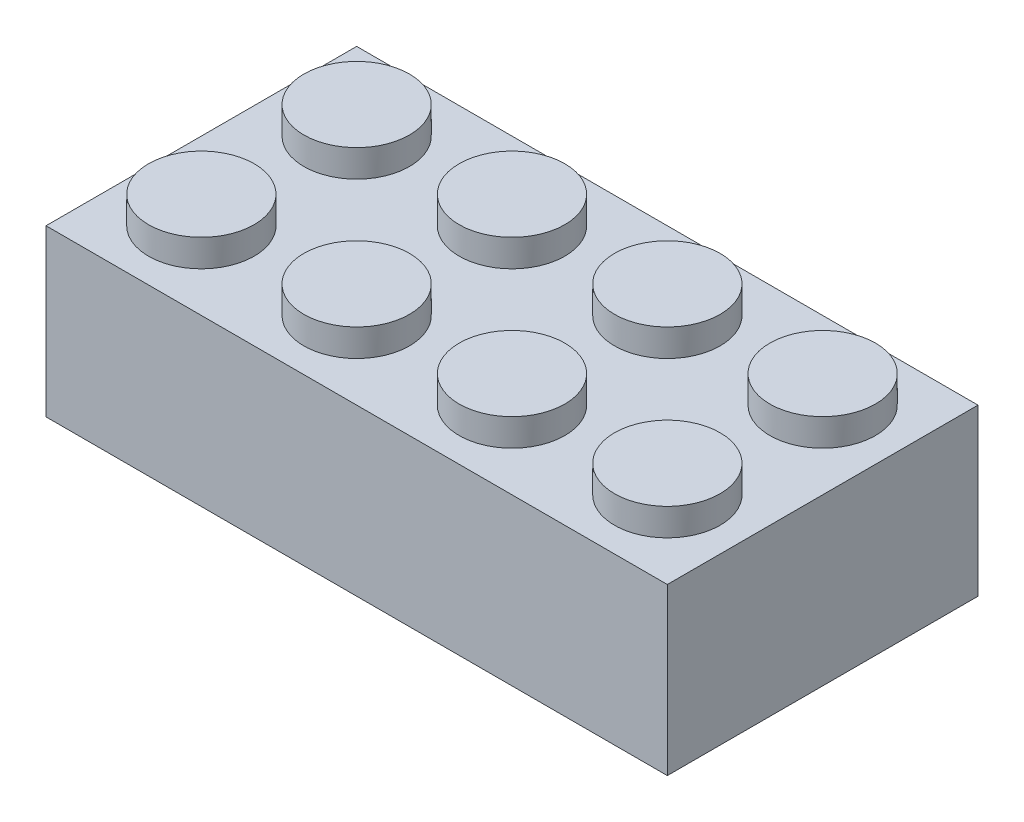
ISO-10303-21;
HEADER;
FILE_DESCRIPTION(('STEP AP214'),'2;1');
FILE_NAME('part.step','',(''),(''),'','','');
FILE_SCHEMA(('AUTOMOTIVE_DESIGN { 1 0 10303 214 1 1 1 1 }'));
ENDSEC;
DATA;
#1=APPLICATION_CONTEXT('core data for automotive mechanical design processes');
#2=APPLICATION_PROTOCOL_DEFINITION('international standard','automotive_design',2000,#1);
#3=PRODUCT_CONTEXT('',#1,'mechanical');
#4=PRODUCT('Part','Part','',(#3));
#5=PRODUCT_RELATED_PRODUCT_CATEGORY('part','',(#4));
#6=PRODUCT_DEFINITION_FORMATION('','',#4);
#7=PRODUCT_DEFINITION_CONTEXT('part definition',#1,'design');
#8=PRODUCT_DEFINITION('design','',#6,#7);
#9=PRODUCT_DEFINITION_SHAPE('','',#8);
#10=(LENGTH_UNIT() NAMED_UNIT(*) SI_UNIT(.MILLI.,.METRE.));
#11=(NAMED_UNIT(*) PLANE_ANGLE_UNIT() SI_UNIT($,.RADIAN.));
#12=(NAMED_UNIT(*) SI_UNIT($,.STERADIAN.) SOLID_ANGLE_UNIT());
#13=UNCERTAINTY_MEASURE_WITH_UNIT(LENGTH_MEASURE(1.E-05),#10,'distance_accuracy_value','');
#14=(GEOMETRIC_REPRESENTATION_CONTEXT(3) GLOBAL_UNCERTAINTY_ASSIGNED_CONTEXT((#13)) GLOBAL_UNIT_ASSIGNED_CONTEXT((#10,
#11,#12)) REPRESENTATION_CONTEXT('',''));
#15=CARTESIAN_POINT('',(0.,0.,0.));
#16=DIRECTION('',(0.,0.,1.));
#17=DIRECTION('',(1.,0.,0.));
#18=AXIS2_PLACEMENT_3D('',#15,#16,#17);
#19=CARTESIAN_POINT('',(-15.875,4.2291,7.9375));
#20=DIRECTION('',(0.,-1.,0.));
#21=DIRECTION('',(0.,0.,-1.));
#22=AXIS2_PLACEMENT_3D('',#19,#20,#21);
#23=PLANE('',#22);
#24=CARTESIAN_POINT('',(11.90625,4.2291,3.96875));
#25=DIRECTION('',(0.,-1.,0.));
#26=DIRECTION('',(0.,0.,-1.));
#27=AXIS2_PLACEMENT_3D('',#24,#25,#26);
#28=CIRCLE('',#27,2.69875);
#29=CARTESIAN_POINT('',(11.90625,4.2291,1.27));
#30=VERTEX_POINT('',#29);
#31=EDGE_CURVE('E194',#30,#30,#28,.F.);
#32=ORIENTED_EDGE('',*,*,#31,.F.);
#33=EDGE_LOOP('',(#32));
#34=FACE_BOUND('',#33,.T.);
#35=DIRECTION('',(0.,0.,1.));
#36=VECTOR('',#35,1.);
#37=CARTESIAN_POINT('',(-15.875,4.2291,-7.9375));
#38=LINE('',#37,#36);
#39=CARTESIAN_POINT('',(-15.875,4.2291,-7.9375));
#40=VERTEX_POINT('',#39);
#41=CARTESIAN_POINT('',(-15.875,4.2291,7.9375));
#42=VERTEX_POINT('',#41);
#43=EDGE_CURVE('E172',#40,#42,#38,.T.);
#44=ORIENTED_EDGE('',*,*,#43,.T.);
#45=DIRECTION('',(1.,0.,0.));
#46=VECTOR('',#45,1.);
#47=CARTESIAN_POINT('',(15.875,4.2291,7.9375));
#48=LINE('',#47,#46);
#49=CARTESIAN_POINT('',(15.875,4.2291,7.9375));
#50=VERTEX_POINT('',#49);
#51=EDGE_CURVE('E114',#42,#50,#48,.T.);
#52=ORIENTED_EDGE('',*,*,#51,.T.);
#53=DIRECTION('',(0.,0.,-1.));
#54=VECTOR('',#53,1.);
#55=CARTESIAN_POINT('',(15.875,4.2291,-7.9375));
#56=LINE('',#55,#54);
#57=CARTESIAN_POINT('',(15.875,4.2291,-7.9375));
#58=VERTEX_POINT('',#57);
#59=EDGE_CURVE('E175',#50,#58,#56,.T.);
#60=ORIENTED_EDGE('',*,*,#59,.T.);
#61=DIRECTION('',(-1.,0.,0.));
#62=VECTOR('',#61,1.);
#63=CARTESIAN_POINT('',(15.875,4.2291,-7.9375));
#64=LINE('',#63,#62);
#65=EDGE_CURVE('E85',#58,#40,#64,.T.);
#66=ORIENTED_EDGE('',*,*,#65,.T.);
#67=EDGE_LOOP('',(#44,#52,#60,#66));
#68=FACE_BOUND('',#67,.T.);
#69=CARTESIAN_POINT('',(3.96875,4.2291,3.96875000000001));
#70=DIRECTION('',(0.,-1.,0.));
#71=DIRECTION('',(0.,0.,-1.));
#72=AXIS2_PLACEMENT_3D('',#69,#70,#71);
#73=CIRCLE('',#72,2.69875);
#74=CARTESIAN_POINT('',(3.96875,4.2291,1.27000000000001));
#75=VERTEX_POINT('',#74);
#76=EDGE_CURVE('E197',#75,#75,#73,.F.);
#77=ORIENTED_EDGE('',*,*,#76,.F.);
#78=EDGE_LOOP('',(#77));
#79=FACE_BOUND('',#78,.T.);
#80=CARTESIAN_POINT('',(-3.96875,4.2291,3.96875000000001));
#81=DIRECTION('',(0.,-1.,0.));
#82=DIRECTION('',(0.,0.,-1.));
#83=AXIS2_PLACEMENT_3D('',#80,#81,#82);
#84=CIRCLE('',#83,2.69875);
#85=CARTESIAN_POINT('',(-3.96875,4.2291,1.27000000000001));
#86=VERTEX_POINT('',#85);
#87=EDGE_CURVE('E200',#86,#86,#84,.F.);
#88=ORIENTED_EDGE('',*,*,#87,.F.);
#89=EDGE_LOOP('',(#88));
#90=FACE_BOUND('',#89,.T.);
#91=CARTESIAN_POINT('',(-11.90625,4.2291,3.96875000000001));
#92=DIRECTION('',(0.,-1.,0.));
#93=DIRECTION('',(0.,0.,-1.));
#94=AXIS2_PLACEMENT_3D('',#91,#92,#93);
#95=CIRCLE('',#94,2.69875);
#96=CARTESIAN_POINT('',(-11.90625,4.2291,1.27000000000001));
#97=VERTEX_POINT('',#96);
#98=EDGE_CURVE('E206',#97,#97,#95,.F.);
#99=ORIENTED_EDGE('',*,*,#98,.F.);
#100=EDGE_LOOP('',(#99));
#101=FACE_BOUND('',#100,.T.);
#102=CARTESIAN_POINT('',(11.90625,4.2291,-3.96875));
#103=DIRECTION('',(0.,-1.,0.));
#104=DIRECTION('',(0.,0.,-1.));
#105=AXIS2_PLACEMENT_3D('',#102,#103,#104);
#106=CIRCLE('',#105,2.69875);
#107=CARTESIAN_POINT('',(11.90625,4.2291,-6.6675));
#108=VERTEX_POINT('',#107);
#109=EDGE_CURVE('E212',#108,#108,#106,.F.);
#110=ORIENTED_EDGE('',*,*,#109,.F.);
#111=EDGE_LOOP('',(#110));
#112=FACE_BOUND('',#111,.T.);
#113=CARTESIAN_POINT('',(3.96875,4.2291,-3.96874999999999));
#114=DIRECTION('',(0.,-1.,0.));
#115=DIRECTION('',(0.,0.,-1.));
#116=AXIS2_PLACEMENT_3D('',#113,#114,#115);
#117=CIRCLE('',#116,2.69875);
#118=CARTESIAN_POINT('',(3.96875,4.2291,-6.66749999999999));
#119=VERTEX_POINT('',#118);
#120=EDGE_CURVE('E218',#119,#119,#117,.F.);
#121=ORIENTED_EDGE('',*,*,#120,.F.);
#122=EDGE_LOOP('',(#121));
#123=FACE_BOUND('',#122,.T.);
#124=CARTESIAN_POINT('',(-3.96875,4.2291,-3.96874999999999));
#125=DIRECTION('',(0.,-1.,0.));
#126=DIRECTION('',(0.,0.,-1.));
#127=AXIS2_PLACEMENT_3D('',#124,#125,#126);
#128=CIRCLE('',#127,2.69875);
#129=CARTESIAN_POINT('',(-3.96875,4.2291,-6.66749999999999));
#130=VERTEX_POINT('',#129);
#131=EDGE_CURVE('E224',#130,#130,#128,.F.);
#132=ORIENTED_EDGE('',*,*,#131,.F.);
#133=EDGE_LOOP('',(#132));
#134=FACE_BOUND('',#133,.T.);
#135=CARTESIAN_POINT('',(-11.90625,4.2291,-3.96874999999999));
#136=DIRECTION('',(0.,-1.,0.));
#137=DIRECTION('',(0.,0.,-1.));
#138=AXIS2_PLACEMENT_3D('',#135,#136,#137);
#139=CIRCLE('',#138,2.69875);
#140=CARTESIAN_POINT('',(-11.90625,4.2291,-6.66749999999999));
#141=VERTEX_POINT('',#140);
#142=EDGE_CURVE('E230',#141,#141,#139,.F.);
#143=ORIENTED_EDGE('',*,*,#142,.F.);
#144=EDGE_LOOP('',(#143));
#145=FACE_BOUND('',#144,.T.);
#146=ADVANCED_FACE('F61',(#34,#68,#79,#90,#101,#112,#123,#134,#145),#23,.F.);
#147=CARTESIAN_POINT('',(-15.875,4.2291,-7.9375));
#148=DIRECTION('',(1.,0.,0.));
#149=DIRECTION('',(0.,0.,-1.));
#150=AXIS2_PLACEMENT_3D('',#147,#148,#149);
#151=PLANE('',#150);
#152=DIRECTION('',(0.,0.,1.));
#153=VECTOR('',#152,1.);
#154=CARTESIAN_POINT('',(-15.875,-4.2291,-7.9375));
#155=LINE('',#154,#153);
#156=CARTESIAN_POINT('',(-15.875,-4.2291,-7.9375));
#157=VERTEX_POINT('',#156);
#158=CARTESIAN_POINT('',(-15.875,-4.2291,7.9375));
#159=VERTEX_POINT('',#158);
#160=EDGE_CURVE('E170',#157,#159,#155,.T.);
#161=ORIENTED_EDGE('',*,*,#160,.T.);
#162=DIRECTION('',(0.,-1.,0.));
#163=VECTOR('',#162,1.);
#164=CARTESIAN_POINT('',(-15.875,4.2291,7.9375));
#165=LINE('',#164,#163);
#166=EDGE_CURVE('E192',#42,#159,#165,.T.);
#167=ORIENTED_EDGE('',*,*,#166,.F.);
#168=ORIENTED_EDGE('',*,*,#43,.F.);
#169=DIRECTION('',(0.,-1.,0.));
#170=VECTOR('',#169,1.);
#171=CARTESIAN_POINT('',(-15.875,4.2291,-7.9375));
#172=LINE('',#171,#170);
#173=EDGE_CURVE('E178',#40,#157,#172,.T.);
#174=ORIENTED_EDGE('',*,*,#173,.T.);
#175=EDGE_LOOP('',(#161,#167,#168,#174));
#176=FACE_BOUND('',#175,.T.);
#177=ADVANCED_FACE('F274',(#176),#151,.F.);
#178=CARTESIAN_POINT('',(15.875,4.2291,7.9375));
#179=DIRECTION('',(0.,0.,-1.));
#180=DIRECTION('',(-1.,0.,0.));
#181=AXIS2_PLACEMENT_3D('',#178,#179,#180);
#182=PLANE('',#181);
#183=DIRECTION('',(1.,0.,0.));
#184=VECTOR('',#183,1.);
#185=CARTESIAN_POINT('',(15.875,-4.2291,7.9375));
#186=LINE('',#185,#184);
#187=CARTESIAN_POINT('',(15.875,-4.2291,7.9375));
#188=VERTEX_POINT('',#187);
#189=EDGE_CURVE('E181',#159,#188,#186,.T.);
#190=ORIENTED_EDGE('',*,*,#189,.T.);
#191=DIRECTION('',(0.,-1.,0.));
#192=VECTOR('',#191,1.);
#193=CARTESIAN_POINT('',(15.875,4.2291,7.9375));
#194=LINE('',#193,#192);
#195=EDGE_CURVE('E189',#50,#188,#194,.T.);
#196=ORIENTED_EDGE('',*,*,#195,.F.);
#197=ORIENTED_EDGE('',*,*,#51,.F.);
#198=ORIENTED_EDGE('',*,*,#166,.T.);
#199=EDGE_LOOP('',(#190,#196,#197,#198));
#200=FACE_BOUND('',#199,.T.);
#201=ADVANCED_FACE('F279',(#200),#182,.F.);
#202=CARTESIAN_POINT('',(15.875,4.2291,-7.9375));
#203=DIRECTION('',(-1.,0.,0.));
#204=DIRECTION('',(0.,0.,1.));
#205=AXIS2_PLACEMENT_3D('',#202,#203,#204);
#206=PLANE('',#205);
#207=DIRECTION('',(0.,0.,-1.));
#208=VECTOR('',#207,1.);
#209=CARTESIAN_POINT('',(15.875,-4.2291,-7.9375));
#210=LINE('',#209,#208);
#211=CARTESIAN_POINT('',(15.875,-4.2291,-7.9375));
#212=VERTEX_POINT('',#211);
#213=EDGE_CURVE('E183',#188,#212,#210,.T.);
#214=ORIENTED_EDGE('',*,*,#213,.T.);
#215=DIRECTION('',(0.,-1.,0.));
#216=VECTOR('',#215,1.);
#217=CARTESIAN_POINT('',(15.875,4.2291,-7.9375));
#218=LINE('',#217,#216);
#219=EDGE_CURVE('E187',#58,#212,#218,.T.);
#220=ORIENTED_EDGE('',*,*,#219,.F.);
#221=ORIENTED_EDGE('',*,*,#59,.F.);
#222=ORIENTED_EDGE('',*,*,#195,.T.);
#223=EDGE_LOOP('',(#214,#220,#221,#222));
#224=FACE_BOUND('',#223,.T.);
#225=ADVANCED_FACE('F286',(#224),#206,.F.);
#226=CARTESIAN_POINT('',(15.875,4.2291,-7.9375));
#227=DIRECTION('',(0.,0.,1.));
#228=DIRECTION('',(1.,0.,0.));
#229=AXIS2_PLACEMENT_3D('',#226,#227,#228);
#230=PLANE('',#229);
#231=DIRECTION('',(-1.,0.,0.));
#232=VECTOR('',#231,1.);
#233=CARTESIAN_POINT('',(15.875,-4.2291,-7.9375));
#234=LINE('',#233,#232);
#235=EDGE_CURVE('E106',#212,#157,#234,.T.);
#236=ORIENTED_EDGE('',*,*,#235,.T.);
#237=ORIENTED_EDGE('',*,*,#173,.F.);
#238=ORIENTED_EDGE('',*,*,#65,.F.);
#239=ORIENTED_EDGE('',*,*,#219,.T.);
#240=EDGE_LOOP('',(#236,#237,#238,#239));
#241=FACE_BOUND('',#240,.T.);
#242=ADVANCED_FACE('F269',(#241),#230,.F.);
#243=CARTESIAN_POINT('',(-15.875,-4.2291,7.9375));
#244=DIRECTION('',(0.,-1.,0.));
#245=DIRECTION('',(0.,0.,-1.));
#246=AXIS2_PLACEMENT_3D('',#243,#244,#245);
#247=PLANE('',#246);
#248=DIRECTION('',(0.,0.,1.));
#249=VECTOR('',#248,1.);
#250=CARTESIAN_POINT('',(14.605,-4.2291,-27.7520581765825));
#251=LINE('',#250,#249);
#252=CARTESIAN_POINT('',(14.605,-4.2291,-6.6675));
#253=VERTEX_POINT('',#252);
#254=CARTESIAN_POINT('',(14.605,-4.2291,6.6675));
#255=VERTEX_POINT('',#254);
#256=EDGE_CURVE('E76',#253,#255,#251,.T.);
#257=ORIENTED_EDGE('',*,*,#256,.F.);
#258=DIRECTION('',(1.,0.,0.));
#259=VECTOR('',#258,1.);
#260=CARTESIAN_POINT('',(0.,-4.2291,-6.6675));
#261=LINE('',#260,#259);
#262=CARTESIAN_POINT('',(-14.605,-4.2291,-6.6675));
#263=VERTEX_POINT('',#262);
#264=EDGE_CURVE('E159',#263,#253,#261,.T.);
#265=ORIENTED_EDGE('',*,*,#264,.F.);
#266=DIRECTION('',(0.,0.,-1.));
#267=VECTOR('',#266,1.);
#268=CARTESIAN_POINT('',(-14.605,-4.2291,-27.7520581765825));
#269=LINE('',#268,#267);
#270=CARTESIAN_POINT('',(-14.605,-4.2291,6.6675));
#271=VERTEX_POINT('',#270);
#272=EDGE_CURVE('E142',#271,#263,#269,.T.);
#273=ORIENTED_EDGE('',*,*,#272,.F.);
#274=DIRECTION('',(-1.,0.,0.));
#275=VECTOR('',#274,1.);
#276=CARTESIAN_POINT('',(0.,-4.2291,6.6675));
#277=LINE('',#276,#275);
#278=EDGE_CURVE('E152',#255,#271,#277,.T.);
#279=ORIENTED_EDGE('',*,*,#278,.F.);
#280=EDGE_LOOP('',(#257,#265,#273,#279));
#281=FACE_BOUND('',#280,.T.);
#282=ORIENTED_EDGE('',*,*,#160,.F.);
#283=ORIENTED_EDGE('',*,*,#235,.F.);
#284=ORIENTED_EDGE('',*,*,#213,.F.);
#285=ORIENTED_EDGE('',*,*,#189,.F.);
#286=EDGE_LOOP('',(#282,#283,#284,#285));
#287=FACE_BOUND('',#286,.T.);
#288=ADVANCED_FACE('F156',(#281,#287),#247,.T.);
#289=CARTESIAN_POINT('',(14.605,36.3390100746171,-27.7520581765825));
#290=DIRECTION('',(1.,0.,0.));
#291=DIRECTION('',(0.,0.,-1.));
#292=AXIS2_PLACEMENT_3D('',#289,#290,#291);
#293=PLANE('',#292);
#294=DIRECTION('',(0.,0.,-1.));
#295=VECTOR('',#294,1.);
#296=CARTESIAN_POINT('',(14.605,2.9591,-27.7520581765825));
#297=LINE('',#296,#295);
#298=CARTESIAN_POINT('',(14.605,2.9591,6.6675));
#299=VERTEX_POINT('',#298);
#300=CARTESIAN_POINT('',(14.605,2.9591,-6.6675));
#301=VERTEX_POINT('',#300);
#302=EDGE_CURVE('E171',#299,#301,#297,.T.);
#303=ORIENTED_EDGE('',*,*,#302,.T.);
#304=DIRECTION('',(0.,-1.,0.));
#305=VECTOR('',#304,1.);
#306=CARTESIAN_POINT('',(14.605,36.3390100746171,-6.6675));
#307=LINE('',#306,#305);
#308=EDGE_CURVE('E164',#301,#253,#307,.T.);
#309=ORIENTED_EDGE('',*,*,#308,.T.);
#310=ORIENTED_EDGE('',*,*,#256,.T.);
#311=DIRECTION('',(0.,-1.,0.));
#312=VECTOR('',#311,1.);
#313=CARTESIAN_POINT('',(14.605,36.3390100746171,6.66749999999999));
#314=LINE('',#313,#312);
#315=EDGE_CURVE('E149',#299,#255,#314,.T.);
#316=ORIENTED_EDGE('',*,*,#315,.F.);
#317=EDGE_LOOP('',(#303,#309,#310,#316));
#318=FACE_BOUND('',#317,.T.);
#319=ADVANCED_FACE('F259',(#318),#293,.F.);
#320=CARTESIAN_POINT('',(0.,36.3390100746171,-6.6675));
#321=DIRECTION('',(0.,0.,-1.));
#322=DIRECTION('',(-1.,0.,0.));
#323=AXIS2_PLACEMENT_3D('',#320,#321,#322);
#324=PLANE('',#323);
#325=DIRECTION('',(-1.,0.,0.));
#326=VECTOR('',#325,1.);
#327=CARTESIAN_POINT('',(0.,2.9591,-6.6675));
#328=LINE('',#327,#326);
#329=CARTESIAN_POINT('',(-14.605,2.9591,-6.6675));
#330=VERTEX_POINT('',#329);
#331=EDGE_CURVE('E256',#301,#330,#328,.T.);
#332=ORIENTED_EDGE('',*,*,#331,.T.);
#333=DIRECTION('',(0.,-1.,0.));
#334=VECTOR('',#333,1.);
#335=CARTESIAN_POINT('',(-14.605,36.3390100746171,-6.6675));
#336=LINE('',#335,#334);
#337=EDGE_CURVE('E148',#330,#263,#336,.T.);
#338=ORIENTED_EDGE('',*,*,#337,.T.);
#339=ORIENTED_EDGE('',*,*,#264,.T.);
#340=ORIENTED_EDGE('',*,*,#308,.F.);
#341=EDGE_LOOP('',(#332,#338,#339,#340));
#342=FACE_BOUND('',#341,.T.);
#343=ADVANCED_FACE('F261',(#342),#324,.F.);
#344=CARTESIAN_POINT('',(-14.605,36.3390100746171,-27.7520581765825));
#345=DIRECTION('',(-1.,0.,0.));
#346=DIRECTION('',(0.,0.,1.));
#347=AXIS2_PLACEMENT_3D('',#344,#345,#346);
#348=PLANE('',#347);
#349=DIRECTION('',(0.,0.,1.));
#350=VECTOR('',#349,1.);
#351=CARTESIAN_POINT('',(-14.605,2.9591,-27.7520581765825));
#352=LINE('',#351,#350);
#353=CARTESIAN_POINT('',(-14.605,2.9591,6.6675));
#354=VERTEX_POINT('',#353);
#355=EDGE_CURVE('E145',#330,#354,#352,.T.);
#356=ORIENTED_EDGE('',*,*,#355,.T.);
#357=DIRECTION('',(0.,-1.,0.));
#358=VECTOR('',#357,1.);
#359=CARTESIAN_POINT('',(-14.605,36.3390100746171,6.6675));
#360=LINE('',#359,#358);
#361=EDGE_CURVE('E137',#354,#271,#360,.T.);
#362=ORIENTED_EDGE('',*,*,#361,.T.);
#363=ORIENTED_EDGE('',*,*,#272,.T.);
#364=ORIENTED_EDGE('',*,*,#337,.F.);
#365=EDGE_LOOP('',(#356,#362,#363,#364));
#366=FACE_BOUND('',#365,.T.);
#367=ADVANCED_FACE('F139',(#366),#348,.F.);
#368=CARTESIAN_POINT('',(0.,36.3390100746171,6.6675));
#369=DIRECTION('',(0.,0.,1.));
#370=DIRECTION('',(1.,0.,0.));
#371=AXIS2_PLACEMENT_3D('',#368,#369,#370);
#372=PLANE('',#371);
#373=DIRECTION('',(1.,0.,0.));
#374=VECTOR('',#373,1.);
#375=CARTESIAN_POINT('',(0.,2.9591,6.6675));
#376=LINE('',#375,#374);
#377=EDGE_CURVE('E168',#354,#299,#376,.T.);
#378=ORIENTED_EDGE('',*,*,#377,.T.);
#379=ORIENTED_EDGE('',*,*,#315,.T.);
#380=ORIENTED_EDGE('',*,*,#278,.T.);
#381=ORIENTED_EDGE('',*,*,#361,.F.);
#382=EDGE_LOOP('',(#378,#379,#380,#381));
#383=FACE_BOUND('',#382,.T.);
#384=ADVANCED_FACE('F153',(#383),#372,.F.);
#385=CARTESIAN_POINT('',(-15.875,2.9591,7.9375));
#386=DIRECTION('',(0.,-1.,0.));
#387=DIRECTION('',(0.,0.,-1.));
#388=AXIS2_PLACEMENT_3D('',#385,#386,#387);
#389=PLANE('',#388);
#390=CARTESIAN_POINT('',(7.9375,2.9591,0.));
#391=DIRECTION('',(0.,-1.,0.));
#392=DIRECTION('',(0.,0.,-1.));
#393=AXIS2_PLACEMENT_3D('',#390,#391,#392);
#394=CIRCLE('',#393,3.175);
#395=CARTESIAN_POINT('',(7.9375,2.9591,-3.175));
#396=VERTEX_POINT('',#395);
#397=EDGE_CURVE('E13',#396,#396,#394,.T.);
#398=ORIENTED_EDGE('',*,*,#397,.F.);
#399=EDGE_LOOP('',(#398));
#400=FACE_BOUND('',#399,.T.);
#401=CARTESIAN_POINT('',(-7.9375,2.9591,0.));
#402=DIRECTION('',(0.,-1.,0.));
#403=DIRECTION('',(0.,0.,-1.));
#404=AXIS2_PLACEMENT_3D('',#401,#402,#403);
#405=CIRCLE('',#404,3.175);
#406=CARTESIAN_POINT('',(-7.9375,2.9591,-3.175));
#407=VERTEX_POINT('',#406);
#408=EDGE_CURVE('E69',#407,#407,#405,.T.);
#409=ORIENTED_EDGE('',*,*,#408,.F.);
#410=EDGE_LOOP('',(#409));
#411=FACE_BOUND('',#410,.T.);
#412=CARTESIAN_POINT('',(0.,2.9591,0.));
#413=DIRECTION('',(0.,-1.,0.));
#414=DIRECTION('',(0.,0.,-1.));
#415=AXIS2_PLACEMENT_3D('',#412,#413,#414);
#416=CIRCLE('',#415,3.175);
#417=CARTESIAN_POINT('',(0.,2.9591,-3.175));
#418=VERTEX_POINT('',#417);
#419=EDGE_CURVE('E236',#418,#418,#416,.T.);
#420=ORIENTED_EDGE('',*,*,#419,.F.);
#421=EDGE_LOOP('',(#420));
#422=FACE_BOUND('',#421,.T.);
#423=ORIENTED_EDGE('',*,*,#302,.F.);
#424=ORIENTED_EDGE('',*,*,#377,.F.);
#425=ORIENTED_EDGE('',*,*,#355,.F.);
#426=ORIENTED_EDGE('',*,*,#331,.F.);
#427=EDGE_LOOP('',(#423,#424,#425,#426));
#428=FACE_BOUND('',#427,.T.);
#429=ADVANCED_FACE('F244',(#400,#411,#422,#428),#389,.T.);
#430=CARTESIAN_POINT('',(11.90625,5.6261,3.96875));
#431=DIRECTION('',(0.,-1.,0.));
#432=DIRECTION('',(0.,0.,-1.));
#433=AXIS2_PLACEMENT_3D('',#430,#431,#432);
#434=CYLINDRICAL_SURFACE('',#433,2.69875);
#435=CARTESIAN_POINT('',(11.90625,5.6261,3.96875));
#436=DIRECTION('',(0.,1.,0.));
#437=DIRECTION('',(0.,0.,1.));
#438=AXIS2_PLACEMENT_3D('',#435,#436,#437);
#439=CIRCLE('',#438,2.69875);
#440=CARTESIAN_POINT('',(11.90625,5.6261,6.6675));
#441=VERTEX_POINT('',#440);
#442=EDGE_CURVE('E663',#441,#441,#439,.T.);
#443=ORIENTED_EDGE('',*,*,#442,.F.);
#444=EDGE_LOOP('',(#443));
#445=FACE_BOUND('',#444,.T.);
#446=ORIENTED_EDGE('',*,*,#31,.T.);
#447=EDGE_LOOP('',(#446));
#448=FACE_BOUND('',#447,.T.);
#449=ADVANCED_FACE('F247',(#445,#448),#434,.T.);
#450=CARTESIAN_POINT('',(11.90625,5.6261,3.96875));
#451=DIRECTION('',(0.,1.,0.));
#452=DIRECTION('',(0.,0.,1.));
#453=AXIS2_PLACEMENT_3D('',#450,#451,#452);
#454=PLANE('',#453);
#455=ORIENTED_EDGE('',*,*,#442,.T.);
#456=EDGE_LOOP('',(#455));
#457=FACE_BOUND('',#456,.T.);
#458=ADVANCED_FACE('F404',(#457),#454,.T.);
#459=CARTESIAN_POINT('',(3.96875,5.6261,3.96875000000001));
#460=DIRECTION('',(0.,-1.,0.));
#461=DIRECTION('',(0.,0.,-1.));
#462=AXIS2_PLACEMENT_3D('',#459,#460,#461);
#463=CYLINDRICAL_SURFACE('',#462,2.69875);
#464=CARTESIAN_POINT('',(3.96875,5.6261,3.96875000000001));
#465=DIRECTION('',(0.,1.,0.));
#466=DIRECTION('',(0.,0.,1.));
#467=AXIS2_PLACEMENT_3D('',#464,#465,#466);
#468=CIRCLE('',#467,2.69875);
#469=CARTESIAN_POINT('',(3.96875,5.6261,6.6675));
#470=VERTEX_POINT('',#469);
#471=EDGE_CURVE('E660',#470,#470,#468,.T.);
#472=ORIENTED_EDGE('',*,*,#471,.F.);
#473=EDGE_LOOP('',(#472));
#474=FACE_BOUND('',#473,.T.);
#475=ORIENTED_EDGE('',*,*,#76,.T.);
#476=EDGE_LOOP('',(#475));
#477=FACE_BOUND('',#476,.T.);
#478=ADVANCED_FACE('F396',(#474,#477),#463,.T.);
#479=CARTESIAN_POINT('',(3.96875,5.6261,3.96875000000001));
#480=DIRECTION('',(0.,1.,0.));
#481=DIRECTION('',(0.,0.,1.));
#482=AXIS2_PLACEMENT_3D('',#479,#480,#481);
#483=PLANE('',#482);
#484=ORIENTED_EDGE('',*,*,#471,.T.);
#485=EDGE_LOOP('',(#484));
#486=FACE_BOUND('',#485,.T.);
#487=ADVANCED_FACE('F300',(#486),#483,.T.);
#488=CARTESIAN_POINT('',(-3.96875,5.6261,3.96875000000001));
#489=DIRECTION('',(0.,1.,0.));
#490=DIRECTION('',(0.,0.,1.));
#491=AXIS2_PLACEMENT_3D('',#488,#489,#490);
#492=PLANE('',#491);
#493=CARTESIAN_POINT('',(-3.96875,5.6261,3.96875000000001));
#494=DIRECTION('',(0.,1.,0.));
#495=DIRECTION('',(0.,0.,1.));
#496=AXIS2_PLACEMENT_3D('',#493,#494,#495);
#497=CIRCLE('',#496,2.69875);
#498=CARTESIAN_POINT('',(-3.96875,5.6261,6.66750000000001));
#499=VERTEX_POINT('',#498);
#500=EDGE_CURVE('E203',#499,#499,#497,.T.);
#501=ORIENTED_EDGE('',*,*,#500,.T.);
#502=EDGE_LOOP('',(#501));
#503=FACE_BOUND('',#502,.T.);
#504=ADVANCED_FACE('F296',(#503),#492,.T.);
#505=CARTESIAN_POINT('',(-3.96875,5.6261,3.96875000000001));
#506=DIRECTION('',(0.,-1.,0.));
#507=DIRECTION('',(0.,0.,-1.));
#508=AXIS2_PLACEMENT_3D('',#505,#506,#507);
#509=CYLINDRICAL_SURFACE('',#508,2.69875);
#510=ORIENTED_EDGE('',*,*,#500,.F.);
#511=EDGE_LOOP('',(#510));
#512=FACE_BOUND('',#511,.T.);
#513=ORIENTED_EDGE('',*,*,#87,.T.);
#514=EDGE_LOOP('',(#513));
#515=FACE_BOUND('',#514,.T.);
#516=ADVANCED_FACE('F292',(#512,#515),#509,.T.);
#517=CARTESIAN_POINT('',(-11.90625,5.6261,3.96875000000001));
#518=DIRECTION('',(0.,1.,0.));
#519=DIRECTION('',(0.,0.,1.));
#520=AXIS2_PLACEMENT_3D('',#517,#518,#519);
#521=PLANE('',#520);
#522=CARTESIAN_POINT('',(-11.90625,5.6261,3.96875000000001));
#523=DIRECTION('',(0.,1.,0.));
#524=DIRECTION('',(0.,0.,1.));
#525=AXIS2_PLACEMENT_3D('',#522,#523,#524);
#526=CIRCLE('',#525,2.69875);
#527=CARTESIAN_POINT('',(-11.90625,5.6261,6.66750000000001));
#528=VERTEX_POINT('',#527);
#529=EDGE_CURVE('E209',#528,#528,#526,.T.);
#530=ORIENTED_EDGE('',*,*,#529,.T.);
#531=EDGE_LOOP('',(#530));
#532=FACE_BOUND('',#531,.T.);
#533=ADVANCED_FACE('F295',(#532),#521,.T.);
#534=CARTESIAN_POINT('',(-11.90625,5.6261,3.96875000000001));
#535=DIRECTION('',(0.,-1.,0.));
#536=DIRECTION('',(0.,0.,-1.));
#537=AXIS2_PLACEMENT_3D('',#534,#535,#536);
#538=CYLINDRICAL_SURFACE('',#537,2.69875);
#539=ORIENTED_EDGE('',*,*,#529,.F.);
#540=EDGE_LOOP('',(#539));
#541=FACE_BOUND('',#540,.T.);
#542=ORIENTED_EDGE('',*,*,#98,.T.);
#543=EDGE_LOOP('',(#542));
#544=FACE_BOUND('',#543,.T.);
#545=ADVANCED_FACE('F302',(#541,#544),#538,.T.);
#546=CARTESIAN_POINT('',(11.90625,5.6261,-3.96875));
#547=DIRECTION('',(0.,1.,0.));
#548=DIRECTION('',(0.,0.,1.));
#549=AXIS2_PLACEMENT_3D('',#546,#547,#548);
#550=PLANE('',#549);
#551=CARTESIAN_POINT('',(11.90625,5.6261,-3.96875));
#552=DIRECTION('',(0.,1.,0.));
#553=DIRECTION('',(0.,0.,1.));
#554=AXIS2_PLACEMENT_3D('',#551,#552,#553);
#555=CIRCLE('',#554,2.69875);
#556=CARTESIAN_POINT('',(11.90625,5.6261,-1.27));
#557=VERTEX_POINT('',#556);
#558=EDGE_CURVE('E215',#557,#557,#555,.T.);
#559=ORIENTED_EDGE('',*,*,#558,.T.);
#560=EDGE_LOOP('',(#559));
#561=FACE_BOUND('',#560,.T.);
#562=ADVANCED_FACE('F305',(#561),#550,.T.);
#563=CARTESIAN_POINT('',(11.90625,5.6261,-3.96875));
#564=DIRECTION('',(0.,-1.,0.));
#565=DIRECTION('',(0.,0.,-1.));
#566=AXIS2_PLACEMENT_3D('',#563,#564,#565);
#567=CYLINDRICAL_SURFACE('',#566,2.69875);
#568=ORIENTED_EDGE('',*,*,#558,.F.);
#569=EDGE_LOOP('',(#568));
#570=FACE_BOUND('',#569,.T.);
#571=ORIENTED_EDGE('',*,*,#109,.T.);
#572=EDGE_LOOP('',(#571));
#573=FACE_BOUND('',#572,.T.);
#574=ADVANCED_FACE('F310',(#570,#573),#567,.T.);
#575=CARTESIAN_POINT('',(3.96875,5.6261,-3.96874999999999));
#576=DIRECTION('',(0.,1.,0.));
#577=DIRECTION('',(0.,0.,1.));
#578=AXIS2_PLACEMENT_3D('',#575,#576,#577);
#579=PLANE('',#578);
#580=CARTESIAN_POINT('',(3.96875,5.6261,-3.96874999999999));
#581=DIRECTION('',(0.,1.,0.));
#582=DIRECTION('',(0.,0.,1.));
#583=AXIS2_PLACEMENT_3D('',#580,#581,#582);
#584=CIRCLE('',#583,2.69875);
#585=CARTESIAN_POINT('',(3.96875,5.6261,-1.27));
#586=VERTEX_POINT('',#585);
#587=EDGE_CURVE('E221',#586,#586,#584,.T.);
#588=ORIENTED_EDGE('',*,*,#587,.T.);
#589=EDGE_LOOP('',(#588));
#590=FACE_BOUND('',#589,.T.);
#591=ADVANCED_FACE('F313',(#590),#579,.T.);
#592=CARTESIAN_POINT('',(3.96875,5.6261,-3.96874999999999));
#593=DIRECTION('',(0.,-1.,0.));
#594=DIRECTION('',(0.,0.,-1.));
#595=AXIS2_PLACEMENT_3D('',#592,#593,#594);
#596=CYLINDRICAL_SURFACE('',#595,2.69875);
#597=ORIENTED_EDGE('',*,*,#587,.F.);
#598=EDGE_LOOP('',(#597));
#599=FACE_BOUND('',#598,.T.);
#600=ORIENTED_EDGE('',*,*,#120,.T.);
#601=EDGE_LOOP('',(#600));
#602=FACE_BOUND('',#601,.T.);
#603=ADVANCED_FACE('F318',(#599,#602),#596,.T.);
#604=CARTESIAN_POINT('',(-3.96875,5.6261,-3.96874999999999));
#605=DIRECTION('',(0.,1.,0.));
#606=DIRECTION('',(0.,0.,1.));
#607=AXIS2_PLACEMENT_3D('',#604,#605,#606);
#608=PLANE('',#607);
#609=CARTESIAN_POINT('',(-3.96875,5.6261,-3.96874999999999));
#610=DIRECTION('',(0.,1.,0.));
#611=DIRECTION('',(0.,0.,1.));
#612=AXIS2_PLACEMENT_3D('',#609,#610,#611);
#613=CIRCLE('',#612,2.69875);
#614=CARTESIAN_POINT('',(-3.96875,5.6261,-1.26999999999999));
#615=VERTEX_POINT('',#614);
#616=EDGE_CURVE('E227',#615,#615,#613,.T.);
#617=ORIENTED_EDGE('',*,*,#616,.T.);
#618=EDGE_LOOP('',(#617));
#619=FACE_BOUND('',#618,.T.);
#620=ADVANCED_FACE('F321',(#619),#608,.T.);
#621=CARTESIAN_POINT('',(-3.96875,5.6261,-3.96874999999999));
#622=DIRECTION('',(0.,-1.,0.));
#623=DIRECTION('',(0.,0.,-1.));
#624=AXIS2_PLACEMENT_3D('',#621,#622,#623);
#625=CYLINDRICAL_SURFACE('',#624,2.69875);
#626=ORIENTED_EDGE('',*,*,#616,.F.);
#627=EDGE_LOOP('',(#626));
#628=FACE_BOUND('',#627,.T.);
#629=ORIENTED_EDGE('',*,*,#131,.T.);
#630=EDGE_LOOP('',(#629));
#631=FACE_BOUND('',#630,.T.);
#632=ADVANCED_FACE('F326',(#628,#631),#625,.T.);
#633=CARTESIAN_POINT('',(-11.90625,5.6261,-3.96874999999999));
#634=DIRECTION('',(0.,1.,0.));
#635=DIRECTION('',(0.,0.,1.));
#636=AXIS2_PLACEMENT_3D('',#633,#634,#635);
#637=PLANE('',#636);
#638=CARTESIAN_POINT('',(-11.90625,5.6261,-3.96874999999999));
#639=DIRECTION('',(0.,1.,0.));
#640=DIRECTION('',(0.,0.,1.));
#641=AXIS2_PLACEMENT_3D('',#638,#639,#640);
#642=CIRCLE('',#641,2.69875);
#643=CARTESIAN_POINT('',(-11.90625,5.6261,-1.26999999999999));
#644=VERTEX_POINT('',#643);
#645=EDGE_CURVE('E233',#644,#644,#642,.T.);
#646=ORIENTED_EDGE('',*,*,#645,.T.);
#647=EDGE_LOOP('',(#646));
#648=FACE_BOUND('',#647,.T.);
#649=ADVANCED_FACE('F63',(#648),#637,.T.);
#650=CARTESIAN_POINT('',(-11.90625,5.6261,-3.96874999999999));
#651=DIRECTION('',(0.,-1.,0.));
#652=DIRECTION('',(0.,0.,-1.));
#653=AXIS2_PLACEMENT_3D('',#650,#651,#652);
#654=CYLINDRICAL_SURFACE('',#653,2.69875);
#655=ORIENTED_EDGE('',*,*,#645,.F.);
#656=EDGE_LOOP('',(#655));
#657=FACE_BOUND('',#656,.T.);
#658=ORIENTED_EDGE('',*,*,#142,.T.);
#659=EDGE_LOOP('',(#658));
#660=FACE_BOUND('',#659,.T.);
#661=ADVANCED_FACE('F332',(#657,#660),#654,.T.);
#662=CARTESIAN_POINT('',(0.,11.9393561210692,0.));
#663=DIRECTION('',(0.,-1.,0.));
#664=DIRECTION('',(0.,0.,-1.));
#665=AXIS2_PLACEMENT_3D('',#662,#663,#664);
#666=CYLINDRICAL_SURFACE('',#665,3.175);
#667=ORIENTED_EDGE('',*,*,#419,.T.);
#668=EDGE_LOOP('',(#667));
#669=FACE_BOUND('',#668,.T.);
#670=CARTESIAN_POINT('',(0.,-4.2291,0.));
#671=DIRECTION('',(0.,-1.,0.));
#672=DIRECTION('',(0.,0.,-1.));
#673=AXIS2_PLACEMENT_3D('',#670,#671,#672);
#674=CIRCLE('',#673,3.175);
#675=CARTESIAN_POINT('',(0.,-4.2291,-3.175));
#676=VERTEX_POINT('',#675);
#677=EDGE_CURVE('E654',#676,#676,#674,.T.);
#678=ORIENTED_EDGE('',*,*,#677,.F.);
#679=EDGE_LOOP('',(#678));
#680=FACE_BOUND('',#679,.T.);
#681=ADVANCED_FACE('F334',(#669,#680),#666,.T.);
#682=CARTESIAN_POINT('',(0.,-4.2291,-27.7520581765825));
#683=DIRECTION('',(0.,-1.,0.));
#684=DIRECTION('',(0.,0.,-1.));
#685=AXIS2_PLACEMENT_3D('',#682,#683,#684);
#686=PLANE('',#685);
#687=CARTESIAN_POINT('',(0.,-4.2291,0.));
#688=DIRECTION('',(0.,-1.,0.));
#689=DIRECTION('',(0.,0.,-1.));
#690=AXIS2_PLACEMENT_3D('',#687,#688,#689);
#691=CIRCLE('',#690,2.413);
#692=CARTESIAN_POINT('',(0.,-4.2291,-2.413));
#693=VERTEX_POINT('',#692);
#694=EDGE_CURVE('E651',#693,#693,#691,.T.);
#695=ORIENTED_EDGE('',*,*,#694,.F.);
#696=EDGE_LOOP('',(#695));
#697=FACE_BOUND('',#696,.T.);
#698=ORIENTED_EDGE('',*,*,#677,.T.);
#699=EDGE_LOOP('',(#698));
#700=FACE_BOUND('',#699,.T.);
#701=ADVANCED_FACE('F340',(#697,#700),#686,.T.);
#702=CARTESIAN_POINT('',(0.,11.9393561210692,0.));
#703=DIRECTION('',(0.,-1.,0.));
#704=DIRECTION('',(0.,0.,-1.));
#705=AXIS2_PLACEMENT_3D('',#702,#703,#704);
#706=CYLINDRICAL_SURFACE('',#705,2.413);
#707=CARTESIAN_POINT('',(0.,2.9591,0.));
#708=DIRECTION('',(0.,-1.,0.));
#709=DIRECTION('',(0.,0.,-1.));
#710=AXIS2_PLACEMENT_3D('',#707,#708,#709);
#711=CIRCLE('',#710,2.413);
#712=CARTESIAN_POINT('',(0.,2.9591,-2.413));
#713=VERTEX_POINT('',#712);
#714=EDGE_CURVE('E657',#713,#713,#711,.F.);
#715=ORIENTED_EDGE('',*,*,#714,.T.);
#716=EDGE_LOOP('',(#715));
#717=FACE_BOUND('',#716,.T.);
#718=ORIENTED_EDGE('',*,*,#694,.T.);
#719=EDGE_LOOP('',(#718));
#720=FACE_BOUND('',#719,.T.);
#721=ADVANCED_FACE('F529',(#717,#720),#706,.F.);
#722=ORIENTED_EDGE('',*,*,#714,.F.);
#723=EDGE_LOOP('',(#722));
#724=FACE_BOUND('',#723,.T.);
#725=ADVANCED_FACE('F251',(#724),#389,.T.);
#726=CARTESIAN_POINT('',(-7.9375,11.9393561210692,0.));
#727=DIRECTION('',(0.,-1.,0.));
#728=DIRECTION('',(0.,0.,-1.));
#729=AXIS2_PLACEMENT_3D('',#726,#727,#728);
#730=CYLINDRICAL_SURFACE('',#729,3.175);
#731=ORIENTED_EDGE('',*,*,#408,.T.);
#732=EDGE_LOOP('',(#731));
#733=FACE_BOUND('',#732,.T.);
#734=CARTESIAN_POINT('',(-7.9375,-4.2291,0.));
#735=DIRECTION('',(0.,-1.,0.));
#736=DIRECTION('',(0.,0.,-1.));
#737=AXIS2_PLACEMENT_3D('',#734,#735,#736);
#738=CIRCLE('',#737,3.175);
#739=CARTESIAN_POINT('',(-7.9375,-4.2291,-3.175));
#740=VERTEX_POINT('',#739);
#741=EDGE_CURVE('E645',#740,#740,#738,.T.);
#742=ORIENTED_EDGE('',*,*,#741,.F.);
#743=EDGE_LOOP('',(#742));
#744=FACE_BOUND('',#743,.T.);
#745=ADVANCED_FACE('F241',(#733,#744),#730,.T.);
#746=CARTESIAN_POINT('',(-7.9375,-4.2291,-27.7520581765825));
#747=DIRECTION('',(0.,-1.,0.));
#748=DIRECTION('',(0.,0.,-1.));
#749=AXIS2_PLACEMENT_3D('',#746,#747,#748);
#750=PLANE('',#749);
#751=CARTESIAN_POINT('',(-7.9375,-4.2291,0.));
#752=DIRECTION('',(0.,-1.,0.));
#753=DIRECTION('',(0.,0.,-1.));
#754=AXIS2_PLACEMENT_3D('',#751,#752,#753);
#755=CIRCLE('',#754,2.413);
#756=CARTESIAN_POINT('',(-7.9375,-4.2291,-2.413));
#757=VERTEX_POINT('',#756);
#758=EDGE_CURVE('E642',#757,#757,#755,.T.);
#759=ORIENTED_EDGE('',*,*,#758,.F.);
#760=EDGE_LOOP('',(#759));
#761=FACE_BOUND('',#760,.T.);
#762=ORIENTED_EDGE('',*,*,#741,.T.);
#763=EDGE_LOOP('',(#762));
#764=FACE_BOUND('',#763,.T.);
#765=ADVANCED_FACE('F577',(#761,#764),#750,.T.);
#766=CARTESIAN_POINT('',(-7.9375,11.9393561210692,0.));
#767=DIRECTION('',(0.,-1.,0.));
#768=DIRECTION('',(0.,0.,-1.));
#769=AXIS2_PLACEMENT_3D('',#766,#767,#768);
#770=CYLINDRICAL_SURFACE('',#769,2.413);
#771=CARTESIAN_POINT('',(-7.9375,2.9591,0.));
#772=DIRECTION('',(0.,-1.,0.));
#773=DIRECTION('',(0.,0.,-1.));
#774=AXIS2_PLACEMENT_3D('',#771,#772,#773);
#775=CIRCLE('',#774,2.413);
#776=CARTESIAN_POINT('',(-7.9375,2.9591,-2.413));
#777=VERTEX_POINT('',#776);
#778=EDGE_CURVE('E648',#777,#777,#775,.F.);
#779=ORIENTED_EDGE('',*,*,#778,.T.);
#780=EDGE_LOOP('',(#779));
#781=FACE_BOUND('',#780,.T.);
#782=ORIENTED_EDGE('',*,*,#758,.T.);
#783=EDGE_LOOP('',(#782));
#784=FACE_BOUND('',#783,.T.);
#785=ADVANCED_FACE('F559',(#781,#784),#770,.F.);
#786=ORIENTED_EDGE('',*,*,#778,.F.);
#787=EDGE_LOOP('',(#786));
#788=FACE_BOUND('',#787,.T.);
#789=ADVANCED_FACE('F531',(#788),#389,.T.);
#790=CARTESIAN_POINT('',(7.9375,11.9393561210692,0.));
#791=DIRECTION('',(0.,-1.,0.));
#792=DIRECTION('',(0.,0.,-1.));
#793=AXIS2_PLACEMENT_3D('',#790,#791,#792);
#794=CYLINDRICAL_SURFACE('',#793,3.175);
#795=ORIENTED_EDGE('',*,*,#397,.T.);
#796=EDGE_LOOP('',(#795));
#797=FACE_BOUND('',#796,.T.);
#798=CARTESIAN_POINT('',(7.9375,-4.2291,0.));
#799=DIRECTION('',(0.,-1.,0.));
#800=DIRECTION('',(0.,0.,-1.));
#801=AXIS2_PLACEMENT_3D('',#798,#799,#800);
#802=CIRCLE('',#801,3.175);
#803=CARTESIAN_POINT('',(7.9375,-4.2291,-3.175));
#804=VERTEX_POINT('',#803);
#805=EDGE_CURVE('E636',#804,#804,#802,.T.);
#806=ORIENTED_EDGE('',*,*,#805,.F.);
#807=EDGE_LOOP('',(#806));
#808=FACE_BOUND('',#807,.T.);
#809=ADVANCED_FACE('F558',(#797,#808),#794,.T.);
#810=CARTESIAN_POINT('',(7.9375,-4.2291,-27.7520581765825));
#811=DIRECTION('',(0.,-1.,0.));
#812=DIRECTION('',(0.,0.,-1.));
#813=AXIS2_PLACEMENT_3D('',#810,#811,#812);
#814=PLANE('',#813);
#815=CARTESIAN_POINT('',(7.9375,-4.2291,0.));
#816=DIRECTION('',(0.,-1.,0.));
#817=DIRECTION('',(0.,0.,-1.));
#818=AXIS2_PLACEMENT_3D('',#815,#816,#817);
#819=CIRCLE('',#818,2.413);
#820=CARTESIAN_POINT('',(7.9375,-4.2291,-2.413));
#821=VERTEX_POINT('',#820);
#822=EDGE_CURVE('E635',#821,#821,#819,.T.);
#823=ORIENTED_EDGE('',*,*,#822,.F.);
#824=EDGE_LOOP('',(#823));
#825=FACE_BOUND('',#824,.T.);
#826=ORIENTED_EDGE('',*,*,#805,.T.);
#827=EDGE_LOOP('',(#826));
#828=FACE_BOUND('',#827,.T.);
#829=ADVANCED_FACE('F599',(#825,#828),#814,.T.);
#830=CARTESIAN_POINT('',(7.9375,11.9393561210692,0.));
#831=DIRECTION('',(0.,-1.,0.));
#832=DIRECTION('',(0.,0.,-1.));
#833=AXIS2_PLACEMENT_3D('',#830,#831,#832);
#834=CYLINDRICAL_SURFACE('',#833,2.413);
#835=CARTESIAN_POINT('',(7.9375,2.9591,0.));
#836=DIRECTION('',(0.,-1.,0.));
#837=DIRECTION('',(0.,0.,-1.));
#838=AXIS2_PLACEMENT_3D('',#835,#836,#837);
#839=CIRCLE('',#838,2.413);
#840=CARTESIAN_POINT('',(7.9375,2.9591,-2.413));
#841=VERTEX_POINT('',#840);
#842=EDGE_CURVE('E632',#841,#841,#839,.F.);
#843=ORIENTED_EDGE('',*,*,#842,.T.);
#844=EDGE_LOOP('',(#843));
#845=FACE_BOUND('',#844,.T.);
#846=ORIENTED_EDGE('',*,*,#822,.T.);
#847=EDGE_LOOP('',(#846));
#848=FACE_BOUND('',#847,.T.);
#849=ADVANCED_FACE('F569',(#845,#848),#834,.F.);
#850=ORIENTED_EDGE('',*,*,#842,.F.);
#851=EDGE_LOOP('',(#850));
#852=FACE_BOUND('',#851,.T.);
#853=ADVANCED_FACE('F250',(#852),#389,.T.);
#854=CLOSED_SHELL('',(#146,#177,#201,#225,#242,#288,#319,#343,#367,#384,#429,#449,#458,#478,
#487,#504,#516,#533,#545,#562,#574,#591,#603,#620,#632,#649,#661,#681,#701,#721,#725,#745,#765,
#785,#789,#809,#829,#849,#853));
#855=MANIFOLD_SOLID_BREP('B2',#854);
#856=ADVANCED_BREP_SHAPE_REPRESENTATION('',(#18,#855),#14);
#857=SHAPE_DEFINITION_REPRESENTATION(#9,#856);
ENDSEC;
END-ISO-10303-21;
